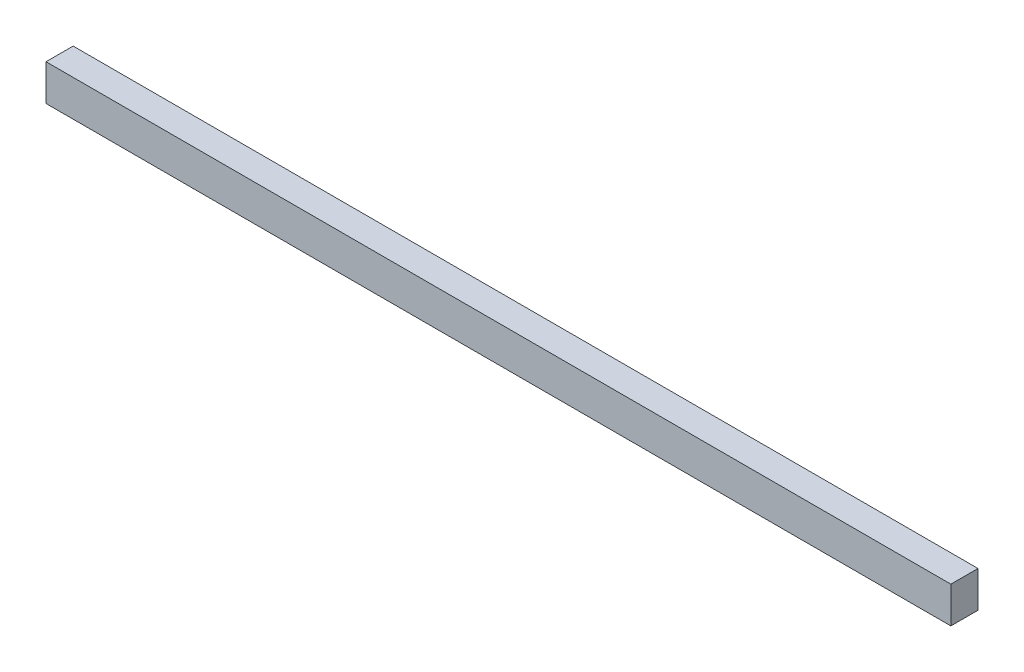
ISO-10303-21;
HEADER;
FILE_DESCRIPTION(('STEP AP214'),'2;1');
FILE_NAME('part.step','',(''),(''),'','','');
FILE_SCHEMA(('AUTOMOTIVE_DESIGN { 1 0 10303 214 1 1 1 1 }'));
ENDSEC;
DATA;
#1=APPLICATION_CONTEXT('core data for automotive mechanical design processes');
#2=APPLICATION_PROTOCOL_DEFINITION('international standard','automotive_design',2000,#1);
#3=PRODUCT_CONTEXT('',#1,'mechanical');
#4=PRODUCT('Part','Part','',(#3));
#5=PRODUCT_RELATED_PRODUCT_CATEGORY('part','',(#4));
#6=PRODUCT_DEFINITION_FORMATION('','',#4);
#7=PRODUCT_DEFINITION_CONTEXT('part definition',#1,'design');
#8=PRODUCT_DEFINITION('design','',#6,#7);
#9=PRODUCT_DEFINITION_SHAPE('','',#8);
#10=(LENGTH_UNIT() NAMED_UNIT(*) SI_UNIT(.MILLI.,.METRE.));
#11=(NAMED_UNIT(*) PLANE_ANGLE_UNIT() SI_UNIT($,.RADIAN.));
#12=(NAMED_UNIT(*) SI_UNIT($,.STERADIAN.) SOLID_ANGLE_UNIT());
#13=UNCERTAINTY_MEASURE_WITH_UNIT(LENGTH_MEASURE(1.E-05),#10,'distance_accuracy_value','');
#14=(GEOMETRIC_REPRESENTATION_CONTEXT(3) GLOBAL_UNCERTAINTY_ASSIGNED_CONTEXT((#13)) GLOBAL_UNIT_ASSIGNED_CONTEXT((#10,
#11,#12)) REPRESENTATION_CONTEXT('',''));
#15=CARTESIAN_POINT('',(0.,0.,0.));
#16=DIRECTION('',(0.,0.,1.));
#17=DIRECTION('',(1.,0.,0.));
#18=AXIS2_PLACEMENT_3D('',#15,#16,#17);
#19=CARTESIAN_POINT('',(2500.,50.,37.5));
#20=DIRECTION('',(0.,0.,-1.));
#21=DIRECTION('',(0.,1.,0.));
#22=AXIS2_PLACEMENT_3D('',#19,#20,#21);
#23=PLANE('',#22);
#24=DIRECTION('',(0.,-1.,0.));
#25=VECTOR('',#24,1.);
#26=CARTESIAN_POINT('',(0.,50.,37.5));
#27=LINE('',#26,#25);
#28=CARTESIAN_POINT('',(0.,50.,37.5));
#29=VERTEX_POINT('',#28);
#30=CARTESIAN_POINT('',(0.,-50.,37.5));
#31=VERTEX_POINT('',#30);
#32=EDGE_CURVE('E103',#29,#31,#27,.T.);
#33=ORIENTED_EDGE('',*,*,#32,.T.);
#34=DIRECTION('',(-1.,0.,0.));
#35=VECTOR('',#34,1.);
#36=CARTESIAN_POINT('',(2500.,-50.,37.5));
#37=LINE('',#36,#35);
#38=CARTESIAN_POINT('',(2500.,-50.,37.5));
#39=VERTEX_POINT('',#38);
#40=EDGE_CURVE('E11',#39,#31,#37,.T.);
#41=ORIENTED_EDGE('',*,*,#40,.F.);
#42=DIRECTION('',(0.,-1.,0.));
#43=VECTOR('',#42,1.);
#44=CARTESIAN_POINT('',(2500.,50.,37.5));
#45=LINE('',#44,#43);
#46=CARTESIAN_POINT('',(2500.,50.,37.5));
#47=VERTEX_POINT('',#46);
#48=EDGE_CURVE('E91',#47,#39,#45,.T.);
#49=ORIENTED_EDGE('',*,*,#48,.F.);
#50=DIRECTION('',(-1.,0.,0.));
#51=VECTOR('',#50,1.);
#52=CARTESIAN_POINT('',(2500.,50.,37.5));
#53=LINE('',#52,#51);
#54=EDGE_CURVE('E99',#47,#29,#53,.T.);
#55=ORIENTED_EDGE('',*,*,#54,.T.);
#56=EDGE_LOOP('',(#33,#41,#49,#55));
#57=FACE_BOUND('',#56,.T.);
#58=ADVANCED_FACE('F40',(#57),#23,.F.);
#59=CARTESIAN_POINT('',(2500.,-50.,-37.5));
#60=DIRECTION('',(0.,1.,0.));
#61=DIRECTION('',(0.,0.,1.));
#62=AXIS2_PLACEMENT_3D('',#59,#60,#61);
#63=PLANE('',#62);
#64=DIRECTION('',(0.,0.,-1.));
#65=VECTOR('',#64,1.);
#66=CARTESIAN_POINT('',(0.,-50.,-37.5));
#67=LINE('',#66,#65);
#68=CARTESIAN_POINT('',(0.,-50.,-37.5));
#69=VERTEX_POINT('',#68);
#70=EDGE_CURVE('E95',#31,#69,#67,.T.);
#71=ORIENTED_EDGE('',*,*,#70,.T.);
#72=DIRECTION('',(-1.,0.,0.));
#73=VECTOR('',#72,1.);
#74=CARTESIAN_POINT('',(2500.,-50.,-37.5));
#75=LINE('',#74,#73);
#76=CARTESIAN_POINT('',(2500.,-50.,-37.5));
#77=VERTEX_POINT('',#76);
#78=EDGE_CURVE('E48',#77,#69,#75,.T.);
#79=ORIENTED_EDGE('',*,*,#78,.F.);
#80=DIRECTION('',(0.,0.,-1.));
#81=VECTOR('',#80,1.);
#82=CARTESIAN_POINT('',(2500.,-50.,-37.5));
#83=LINE('',#82,#81);
#84=EDGE_CURVE('E86',#39,#77,#83,.T.);
#85=ORIENTED_EDGE('',*,*,#84,.F.);
#86=ORIENTED_EDGE('',*,*,#40,.T.);
#87=EDGE_LOOP('',(#71,#79,#85,#86));
#88=FACE_BOUND('',#87,.T.);
#89=ADVANCED_FACE('F94',(#88),#63,.F.);
#90=CARTESIAN_POINT('',(2500.,50.,-37.5));
#91=DIRECTION('',(0.,0.,1.));
#92=DIRECTION('',(0.,-1.,0.));
#93=AXIS2_PLACEMENT_3D('',#90,#91,#92);
#94=PLANE('',#93);
#95=DIRECTION('',(0.,1.,0.));
#96=VECTOR('',#95,1.);
#97=CARTESIAN_POINT('',(0.,50.,-37.5));
#98=LINE('',#97,#96);
#99=CARTESIAN_POINT('',(0.,50.,-37.5));
#100=VERTEX_POINT('',#99);
#101=EDGE_CURVE('E73',#69,#100,#98,.T.);
#102=ORIENTED_EDGE('',*,*,#101,.T.);
#103=DIRECTION('',(-1.,0.,0.));
#104=VECTOR('',#103,1.);
#105=CARTESIAN_POINT('',(2500.,50.,-37.5));
#106=LINE('',#105,#104);
#107=CARTESIAN_POINT('',(2500.,50.,-37.5));
#108=VERTEX_POINT('',#107);
#109=EDGE_CURVE('E96',#108,#100,#106,.T.);
#110=ORIENTED_EDGE('',*,*,#109,.F.);
#111=DIRECTION('',(0.,1.,0.));
#112=VECTOR('',#111,1.);
#113=CARTESIAN_POINT('',(2500.,50.,-37.5));
#114=LINE('',#113,#112);
#115=EDGE_CURVE('E89',#77,#108,#114,.T.);
#116=ORIENTED_EDGE('',*,*,#115,.F.);
#117=ORIENTED_EDGE('',*,*,#78,.T.);
#118=EDGE_LOOP('',(#102,#110,#116,#117));
#119=FACE_BOUND('',#118,.T.);
#120=ADVANCED_FACE('F97',(#119),#94,.F.);
#121=CARTESIAN_POINT('',(2500.,50.,-37.5));
#122=DIRECTION('',(0.,-1.,0.));
#123=DIRECTION('',(0.,0.,-1.));
#124=AXIS2_PLACEMENT_3D('',#121,#122,#123);
#125=PLANE('',#124);
#126=DIRECTION('',(0.,0.,1.));
#127=VECTOR('',#126,1.);
#128=CARTESIAN_POINT('',(0.,50.,-37.5));
#129=LINE('',#128,#127);
#130=EDGE_CURVE('E79',#100,#29,#129,.T.);
#131=ORIENTED_EDGE('',*,*,#130,.T.);
#132=ORIENTED_EDGE('',*,*,#54,.F.);
#133=DIRECTION('',(0.,0.,1.));
#134=VECTOR('',#133,1.);
#135=CARTESIAN_POINT('',(2500.,50.,-37.5));
#136=LINE('',#135,#134);
#137=EDGE_CURVE('E56',#108,#47,#136,.T.);
#138=ORIENTED_EDGE('',*,*,#137,.F.);
#139=ORIENTED_EDGE('',*,*,#109,.T.);
#140=EDGE_LOOP('',(#131,#132,#138,#139));
#141=FACE_BOUND('',#140,.T.);
#142=ADVANCED_FACE('F110',(#141),#125,.F.);
#143=CARTESIAN_POINT('',(2500.,-50.,37.5));
#144=DIRECTION('',(-1.,0.,0.));
#145=DIRECTION('',(0.,0.,1.));
#146=AXIS2_PLACEMENT_3D('',#143,#144,#145);
#147=PLANE('',#146);
#148=ORIENTED_EDGE('',*,*,#48,.T.);
#149=ORIENTED_EDGE('',*,*,#84,.T.);
#150=ORIENTED_EDGE('',*,*,#115,.T.);
#151=ORIENTED_EDGE('',*,*,#137,.T.);
#152=EDGE_LOOP('',(#148,#149,#150,#151));
#153=FACE_BOUND('',#152,.T.);
#154=ADVANCED_FACE('F87',(#153),#147,.F.);
#155=CARTESIAN_POINT('',(0.,-50.,37.5));
#156=DIRECTION('',(-1.,0.,0.));
#157=DIRECTION('',(0.,0.,1.));
#158=AXIS2_PLACEMENT_3D('',#155,#156,#157);
#159=PLANE('',#158);
#160=ORIENTED_EDGE('',*,*,#32,.F.);
#161=ORIENTED_EDGE('',*,*,#130,.F.);
#162=ORIENTED_EDGE('',*,*,#101,.F.);
#163=ORIENTED_EDGE('',*,*,#70,.F.);
#164=EDGE_LOOP('',(#160,#161,#162,#163));
#165=FACE_BOUND('',#164,.T.);
#166=ADVANCED_FACE('F113',(#165),#159,.T.);
#167=CLOSED_SHELL('',(#58,#89,#120,#142,#154,#166));
#168=MANIFOLD_SOLID_BREP('B2',#167);
#169=ADVANCED_BREP_SHAPE_REPRESENTATION('',(#18,#168),#14);
#170=SHAPE_DEFINITION_REPRESENTATION(#9,#169);
ENDSEC;
END-ISO-10303-21;
